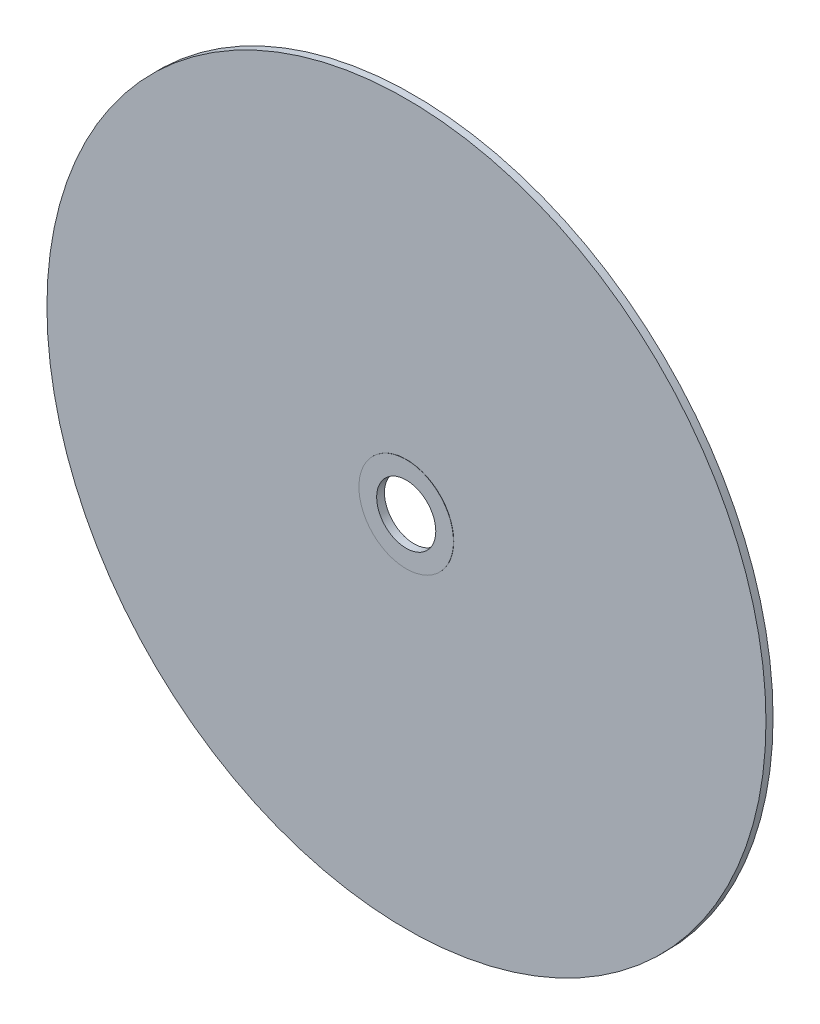
ISO-10303-21;
HEADER;
FILE_DESCRIPTION(('STEP AP214'),'2;1');
FILE_NAME('part.step','',(''),(''),'','','');
FILE_SCHEMA(('AUTOMOTIVE_DESIGN { 1 0 10303 214 1 1 1 1 }'));
ENDSEC;
DATA;
#1=APPLICATION_CONTEXT('core data for automotive mechanical design processes');
#2=APPLICATION_PROTOCOL_DEFINITION('international standard','automotive_design',2000,#1);
#3=PRODUCT_CONTEXT('',#1,'mechanical');
#4=PRODUCT('Part','Part','',(#3));
#5=PRODUCT_RELATED_PRODUCT_CATEGORY('part','',(#4));
#6=PRODUCT_DEFINITION_FORMATION('','',#4);
#7=PRODUCT_DEFINITION_CONTEXT('part definition',#1,'design');
#8=PRODUCT_DEFINITION('design','',#6,#7);
#9=PRODUCT_DEFINITION_SHAPE('','',#8);
#10=(LENGTH_UNIT() NAMED_UNIT(*) SI_UNIT(.MILLI.,.METRE.));
#11=(NAMED_UNIT(*) PLANE_ANGLE_UNIT() SI_UNIT($,.RADIAN.));
#12=(NAMED_UNIT(*) SI_UNIT($,.STERADIAN.) SOLID_ANGLE_UNIT());
#13=UNCERTAINTY_MEASURE_WITH_UNIT(LENGTH_MEASURE(1.E-05),#10,'distance_accuracy_value','');
#14=(GEOMETRIC_REPRESENTATION_CONTEXT(3) GLOBAL_UNCERTAINTY_ASSIGNED_CONTEXT((#13)) GLOBAL_UNIT_ASSIGNED_CONTEXT((#10,
#11,#12)) REPRESENTATION_CONTEXT('',''));
#15=CARTESIAN_POINT('',(0.,0.,0.));
#16=DIRECTION('',(0.,0.,1.));
#17=DIRECTION('',(1.,0.,0.));
#18=AXIS2_PLACEMENT_3D('',#15,#16,#17);
#19=CARTESIAN_POINT('',(0.,0.,-0.2));
#20=DIRECTION('',(0.,0.,1.));
#21=DIRECTION('',(1.,0.,0.));
#22=AXIS2_PLACEMENT_3D('',#19,#20,#21);
#23=CYLINDRICAL_SURFACE('',#22,20.);
#24=CARTESIAN_POINT('',(0.,0.,3.));
#25=DIRECTION('',(0.,0.,1.));
#26=DIRECTION('',(1.,0.,0.));
#27=AXIS2_PLACEMENT_3D('',#24,#25,#26);
#28=CIRCLE('',#27,20.);
#29=CARTESIAN_POINT('',(20.,0.,3.));
#30=VERTEX_POINT('',#29);
#31=EDGE_CURVE('E10',#30,#30,#28,.T.);
#32=ORIENTED_EDGE('',*,*,#31,.T.);
#33=EDGE_LOOP('',(#32));
#34=FACE_BOUND('',#33,.T.);
#35=CARTESIAN_POINT('',(0.,0.,3.1));
#36=DIRECTION('',(0.,0.,1.));
#37=DIRECTION('',(1.,0.,0.));
#38=AXIS2_PLACEMENT_3D('',#35,#36,#37);
#39=CIRCLE('',#38,20.);
#40=CARTESIAN_POINT('',(20.,0.,3.1));
#41=VERTEX_POINT('',#40);
#42=EDGE_CURVE('E55',#41,#41,#39,.T.);
#43=ORIENTED_EDGE('',*,*,#42,.F.);
#44=EDGE_LOOP('',(#43));
#45=FACE_BOUND('',#44,.T.);
#46=ADVANCED_FACE('F30',(#34,#45),#23,.T.);
#47=CARTESIAN_POINT('',(0.,0.,3.1));
#48=DIRECTION('',(0.,0.,1.));
#49=DIRECTION('',(1.,0.,0.));
#50=AXIS2_PLACEMENT_3D('',#47,#48,#49);
#51=PLANE('',#50);
#52=CARTESIAN_POINT('',(0.,0.,3.1));
#53=DIRECTION('',(0.,0.,1.));
#54=DIRECTION('',(1.,0.,0.));
#55=AXIS2_PLACEMENT_3D('',#52,#53,#54);
#56=CIRCLE('',#55,12.5);
#57=CARTESIAN_POINT('',(12.5,0.,3.1));
#58=VERTEX_POINT('',#57);
#59=EDGE_CURVE('E59',#58,#58,#56,.T.);
#60=ORIENTED_EDGE('',*,*,#59,.F.);
#61=EDGE_LOOP('',(#60));
#62=FACE_BOUND('',#61,.T.);
#63=ORIENTED_EDGE('',*,*,#42,.T.);
#64=EDGE_LOOP('',(#63));
#65=FACE_BOUND('',#64,.T.);
#66=ADVANCED_FACE('F85',(#62,#65),#51,.T.);
#67=CARTESIAN_POINT('',(0.,0.,3.));
#68=DIRECTION('',(0.,0.,-1.));
#69=DIRECTION('',(-1.,0.,0.));
#70=AXIS2_PLACEMENT_3D('',#67,#68,#69);
#71=CYLINDRICAL_SURFACE('',#70,152.);
#72=CARTESIAN_POINT('',(0.,0.,3.));
#73=DIRECTION('',(0.,0.,1.));
#74=DIRECTION('',(1.,0.,0.));
#75=AXIS2_PLACEMENT_3D('',#72,#73,#74);
#76=CIRCLE('',#75,152.);
#77=CARTESIAN_POINT('',(152.,0.,3.));
#78=VERTEX_POINT('',#77);
#79=EDGE_CURVE('E38',#78,#78,#76,.T.);
#80=ORIENTED_EDGE('',*,*,#79,.F.);
#81=EDGE_LOOP('',(#80));
#82=FACE_BOUND('',#81,.T.);
#83=CARTESIAN_POINT('',(0.,0.,0.));
#84=DIRECTION('',(0.,0.,1.));
#85=DIRECTION('',(1.,0.,0.));
#86=AXIS2_PLACEMENT_3D('',#83,#84,#85);
#87=CIRCLE('',#86,152.);
#88=CARTESIAN_POINT('',(152.,0.,0.));
#89=VERTEX_POINT('',#88);
#90=EDGE_CURVE('E43',#89,#89,#87,.T.);
#91=ORIENTED_EDGE('',*,*,#90,.T.);
#92=EDGE_LOOP('',(#91));
#93=FACE_BOUND('',#92,.T.);
#94=ADVANCED_FACE('F32',(#82,#93),#71,.T.);
#95=CARTESIAN_POINT('',(0.,0.,3.));
#96=DIRECTION('',(0.,0.,1.));
#97=DIRECTION('',(1.,0.,0.));
#98=AXIS2_PLACEMENT_3D('',#95,#96,#97);
#99=PLANE('',#98);
#100=ORIENTED_EDGE('',*,*,#31,.F.);
#101=EDGE_LOOP('',(#100));
#102=FACE_BOUND('',#101,.T.);
#103=ORIENTED_EDGE('',*,*,#79,.T.);
#104=EDGE_LOOP('',(#103));
#105=FACE_BOUND('',#104,.T.);
#106=ADVANCED_FACE('F82',(#102,#105),#99,.T.);
#107=CARTESIAN_POINT('',(0.,0.,0.));
#108=DIRECTION('',(0.,0.,1.));
#109=DIRECTION('',(1.,0.,0.));
#110=AXIS2_PLACEMENT_3D('',#107,#108,#109);
#111=PLANE('',#110);
#112=CARTESIAN_POINT('',(0.,0.,0.));
#113=DIRECTION('',(0.,0.,1.));
#114=DIRECTION('',(1.,0.,0.));
#115=AXIS2_PLACEMENT_3D('',#112,#113,#114);
#116=CIRCLE('',#115,20.);
#117=CARTESIAN_POINT('',(20.,0.,0.));
#118=VERTEX_POINT('',#117);
#119=EDGE_CURVE('E34',#118,#118,#116,.T.);
#120=ORIENTED_EDGE('',*,*,#119,.T.);
#121=EDGE_LOOP('',(#120));
#122=FACE_BOUND('',#121,.T.);
#123=ORIENTED_EDGE('',*,*,#90,.F.);
#124=EDGE_LOOP('',(#123));
#125=FACE_BOUND('',#124,.T.);
#126=ADVANCED_FACE('F75',(#122,#125),#111,.F.);
#127=CARTESIAN_POINT('',(0.,0.,-0.2));
#128=DIRECTION('',(0.,0.,1.));
#129=DIRECTION('',(1.,0.,0.));
#130=AXIS2_PLACEMENT_3D('',#127,#128,#129);
#131=PLANE('',#130);
#132=CARTESIAN_POINT('',(0.,0.,-0.2));
#133=DIRECTION('',(0.,0.,-1.));
#134=DIRECTION('',(-1.,0.,0.));
#135=AXIS2_PLACEMENT_3D('',#132,#133,#134);
#136=CIRCLE('',#135,12.5);
#137=CARTESIAN_POINT('',(-12.5,0.,-0.2));
#138=VERTEX_POINT('',#137);
#139=EDGE_CURVE('E63',#138,#138,#136,.T.);
#140=ORIENTED_EDGE('',*,*,#139,.F.);
#141=EDGE_LOOP('',(#140));
#142=FACE_BOUND('',#141,.T.);
#143=CARTESIAN_POINT('',(0.,0.,-0.2));
#144=DIRECTION('',(0.,0.,1.));
#145=DIRECTION('',(1.,0.,0.));
#146=AXIS2_PLACEMENT_3D('',#143,#144,#145);
#147=CIRCLE('',#146,20.);
#148=CARTESIAN_POINT('',(20.,0.,-0.2));
#149=VERTEX_POINT('',#148);
#150=EDGE_CURVE('E46',#149,#149,#147,.T.);
#151=ORIENTED_EDGE('',*,*,#150,.F.);
#152=EDGE_LOOP('',(#151));
#153=FACE_BOUND('',#152,.T.);
#154=ADVANCED_FACE('F71',(#142,#153),#131,.F.);
#155=ORIENTED_EDGE('',*,*,#150,.T.);
#156=EDGE_LOOP('',(#155));
#157=FACE_BOUND('',#156,.T.);
#158=ORIENTED_EDGE('',*,*,#119,.F.);
#159=EDGE_LOOP('',(#158));
#160=FACE_BOUND('',#159,.T.);
#161=ADVANCED_FACE('F74',(#157,#160),#23,.T.);
#162=CARTESIAN_POINT('',(0.,0.,49.9));
#163=DIRECTION('',(0.,0.,-1.));
#164=DIRECTION('',(-1.,0.,0.));
#165=AXIS2_PLACEMENT_3D('',#162,#163,#164);
#166=CYLINDRICAL_SURFACE('',#165,12.5);
#167=ORIENTED_EDGE('',*,*,#59,.T.);
#168=EDGE_LOOP('',(#167));
#169=FACE_BOUND('',#168,.T.);
#170=ORIENTED_EDGE('',*,*,#139,.T.);
#171=EDGE_LOOP('',(#170));
#172=FACE_BOUND('',#171,.T.);
#173=ADVANCED_FACE('F69',(#169,#172),#166,.F.);
#174=CLOSED_SHELL('',(#46,#66,#94,#106,#126,#154,#161,#173));
#175=MANIFOLD_SOLID_BREP('B2',#174);
#176=ADVANCED_BREP_SHAPE_REPRESENTATION('',(#18,#175),#14);
#177=SHAPE_DEFINITION_REPRESENTATION(#9,#176);
ENDSEC;
END-ISO-10303-21;
